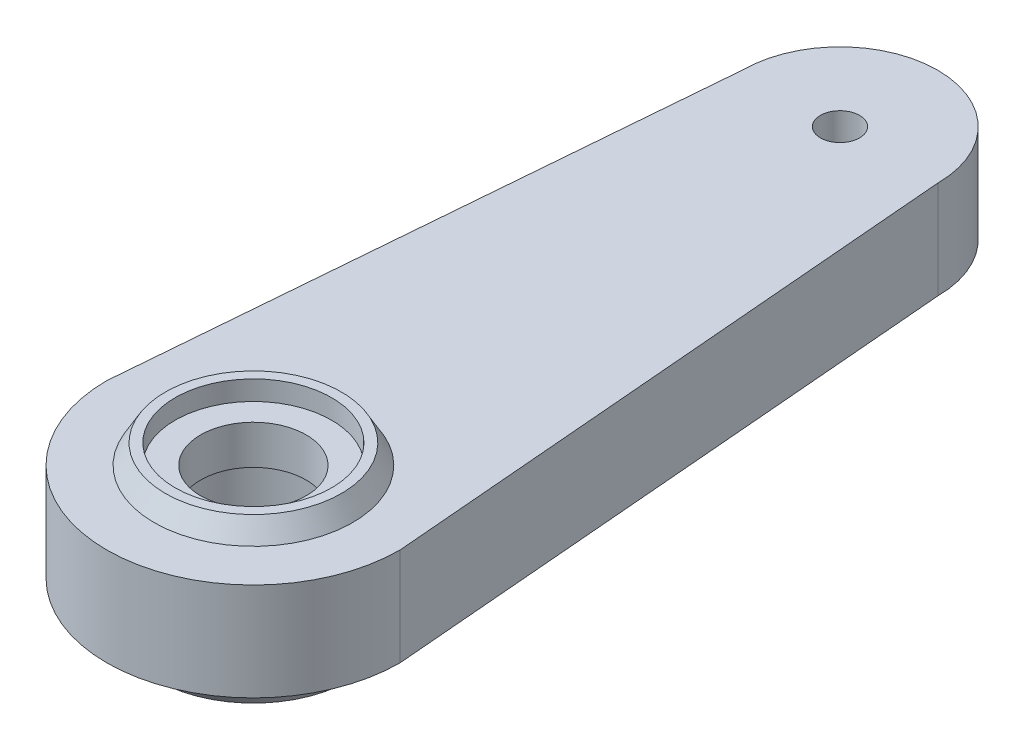
ISO-10303-21;
HEADER;
FILE_DESCRIPTION(('STEP AP214'),'2;1');
FILE_NAME('part.step','',(''),(''),'','','');
FILE_SCHEMA(('AUTOMOTIVE_DESIGN { 1 0 10303 214 1 1 1 1 }'));
ENDSEC;
DATA;
#1=APPLICATION_CONTEXT('core data for automotive mechanical design processes');
#2=APPLICATION_PROTOCOL_DEFINITION('international standard','automotive_design',2000,#1);
#3=PRODUCT_CONTEXT('',#1,'mechanical');
#4=PRODUCT('Part','Part','',(#3));
#5=PRODUCT_RELATED_PRODUCT_CATEGORY('part','',(#4));
#6=PRODUCT_DEFINITION_FORMATION('','',#4);
#7=PRODUCT_DEFINITION_CONTEXT('part definition',#1,'design');
#8=PRODUCT_DEFINITION('design','',#6,#7);
#9=PRODUCT_DEFINITION_SHAPE('','',#8);
#10=(LENGTH_UNIT() NAMED_UNIT(*) SI_UNIT(.MILLI.,.METRE.));
#11=(NAMED_UNIT(*) PLANE_ANGLE_UNIT() SI_UNIT($,.RADIAN.));
#12=(NAMED_UNIT(*) SI_UNIT($,.STERADIAN.) SOLID_ANGLE_UNIT());
#13=UNCERTAINTY_MEASURE_WITH_UNIT(LENGTH_MEASURE(1.E-05),#10,'distance_accuracy_value','');
#14=(GEOMETRIC_REPRESENTATION_CONTEXT(3) GLOBAL_UNCERTAINTY_ASSIGNED_CONTEXT((#13)) GLOBAL_UNIT_ASSIGNED_CONTEXT((#10,
#11,#12)) REPRESENTATION_CONTEXT('',''));
#15=CARTESIAN_POINT('',(0.,0.,0.));
#16=DIRECTION('',(0.,0.,1.));
#17=DIRECTION('',(1.,0.,0.));
#18=AXIS2_PLACEMENT_3D('',#15,#16,#17);
#19=CARTESIAN_POINT('',(0.,5.,0.));
#20=DIRECTION('',(0.,1.,0.));
#21=DIRECTION('',(0.,0.,1.));
#22=AXIS2_PLACEMENT_3D('',#19,#20,#21);
#23=PLANE('',#22);
#24=CARTESIAN_POINT('',(0.,5.,0.));
#25=DIRECTION('',(0.,1.,0.));
#26=DIRECTION('',(0.,0.,1.));
#27=AXIS2_PLACEMENT_3D('',#24,#25,#26);
#28=CIRCLE('',#27,2.7009170163784);
#29=CARTESIAN_POINT('',(0.,5.,2.7009170163784));
#30=VERTEX_POINT('',#29);
#31=EDGE_CURVE('E184',#30,#30,#28,.T.);
#32=ORIENTED_EDGE('',*,*,#31,.F.);
#33=EDGE_LOOP('',(#32));
#34=FACE_BOUND('',#33,.T.);
#35=CARTESIAN_POINT('',(0.,5.,0.));
#36=DIRECTION('',(0.,1.,0.));
#37=DIRECTION('',(0.,0.,1.));
#38=AXIS2_PLACEMENT_3D('',#35,#36,#37);
#39=CIRCLE('',#38,4.);
#40=CARTESIAN_POINT('',(0.,5.,4.));
#41=VERTEX_POINT('',#40);
#42=EDGE_CURVE('E11',#41,#41,#39,.F.);
#43=ORIENTED_EDGE('',*,*,#42,.F.);
#44=EDGE_LOOP('',(#43));
#45=FACE_BOUND('',#44,.T.);
#46=ADVANCED_FACE('F36',(#34,#45),#23,.T.);
#47=CARTESIAN_POINT('',(0.,0.,0.));
#48=DIRECTION('',(0.,1.,0.));
#49=DIRECTION('',(0.,0.,1.));
#50=AXIS2_PLACEMENT_3D('',#47,#48,#49);
#51=CYLINDRICAL_SURFACE('',#50,4.);
#52=CARTESIAN_POINT('',(0.,-2.,0.));
#53=DIRECTION('',(0.,1.,0.));
#54=DIRECTION('',(0.,0.,1.));
#55=AXIS2_PLACEMENT_3D('',#52,#53,#54);
#56=CIRCLE('',#55,4.);
#57=CARTESIAN_POINT('',(0.,-2.,4.));
#58=VERTEX_POINT('',#57);
#59=EDGE_CURVE('E180',#58,#58,#56,.T.);
#60=ORIENTED_EDGE('',*,*,#59,.F.);
#61=EDGE_LOOP('',(#60));
#62=FACE_BOUND('',#61,.T.);
#63=CARTESIAN_POINT('',(0.,3.,0.));
#64=DIRECTION('',(0.,1.,0.));
#65=DIRECTION('',(0.,0.,1.));
#66=AXIS2_PLACEMENT_3D('',#63,#64,#65);
#67=CIRCLE('',#66,4.);
#68=CARTESIAN_POINT('',(0.,3.,4.));
#69=VERTEX_POINT('',#68);
#70=EDGE_CURVE('E46',#69,#69,#67,.F.);
#71=ORIENTED_EDGE('',*,*,#70,.F.);
#72=EDGE_LOOP('',(#71));
#73=FACE_BOUND('',#72,.T.);
#74=ADVANCED_FACE('F123',(#62,#73),#51,.F.);
#75=CARTESIAN_POINT('',(0.,5.,0.));
#76=DIRECTION('',(0.,-1.,0.));
#77=DIRECTION('',(0.,0.,-1.));
#78=AXIS2_PLACEMENT_3D('',#75,#76,#77);
#79=CYLINDRICAL_SURFACE('',#78,7.5);
#80=CARTESIAN_POINT('',(0.,0.,0.));
#81=DIRECTION('',(0.,1.,0.));
#82=DIRECTION('',(0.,0.,1.));
#83=AXIS2_PLACEMENT_3D('',#80,#81,#82);
#84=CIRCLE('',#83,7.5);
#85=CARTESIAN_POINT('',(-7.5,0.,0.));
#86=VERTEX_POINT('',#85);
#87=CARTESIAN_POINT('',(7.5,0.,0.));
#88=VERTEX_POINT('',#87);
#89=EDGE_CURVE('E105',#86,#88,#84,.T.);
#90=ORIENTED_EDGE('',*,*,#89,.T.);
#91=DIRECTION('',(0.,-1.,0.));
#92=VECTOR('',#91,1.);
#93=CARTESIAN_POINT('',(7.5,5.,0.));
#94=LINE('',#93,#92);
#95=CARTESIAN_POINT('',(7.5,5.,0.));
#96=VERTEX_POINT('',#95);
#97=EDGE_CURVE('E96',#96,#88,#94,.T.);
#98=ORIENTED_EDGE('',*,*,#97,.F.);
#99=CARTESIAN_POINT('',(0.,5.,0.));
#100=DIRECTION('',(0.,1.,0.));
#101=DIRECTION('',(0.,0.,1.));
#102=AXIS2_PLACEMENT_3D('',#99,#100,#101);
#103=CIRCLE('',#102,7.5);
#104=CARTESIAN_POINT('',(-7.5,5.,0.));
#105=VERTEX_POINT('',#104);
#106=EDGE_CURVE('E90',#105,#96,#103,.T.);
#107=ORIENTED_EDGE('',*,*,#106,.F.);
#108=DIRECTION('',(0.,-1.,0.));
#109=VECTOR('',#108,1.);
#110=CARTESIAN_POINT('',(-7.5,5.,0.));
#111=LINE('',#110,#109);
#112=EDGE_CURVE('E101',#105,#86,#111,.T.);
#113=ORIENTED_EDGE('',*,*,#112,.T.);
#114=EDGE_LOOP('',(#90,#98,#107,#113));
#115=FACE_BOUND('',#114,.T.);
#116=ADVANCED_FACE('F125',(#115),#79,.T.);
#117=CARTESIAN_POINT('',(5.,5.,-30.));
#118=DIRECTION('',(-0.99654575824488,0.,0.08304547985374));
#119=DIRECTION('',(0.08304547985374,0.,0.99654575824488));
#120=AXIS2_PLACEMENT_3D('',#117,#118,#119);
#121=PLANE('',#120);
#122=DIRECTION('',(-0.08304547985374,0.,-0.99654575824488));
#123=VECTOR('',#122,1.);
#124=CARTESIAN_POINT('',(5.,0.,-30.));
#125=LINE('',#124,#123);
#126=CARTESIAN_POINT('',(5.,0.,-30.));
#127=VERTEX_POINT('',#126);
#128=EDGE_CURVE('E95',#88,#127,#125,.T.);
#129=ORIENTED_EDGE('',*,*,#128,.T.);
#130=DIRECTION('',(0.,-1.,0.));
#131=VECTOR('',#130,1.);
#132=CARTESIAN_POINT('',(5.,5.,-30.));
#133=LINE('',#132,#131);
#134=CARTESIAN_POINT('',(5.,5.,-30.));
#135=VERTEX_POINT('',#134);
#136=EDGE_CURVE('E93',#135,#127,#133,.T.);
#137=ORIENTED_EDGE('',*,*,#136,.F.);
#138=DIRECTION('',(-0.08304547985374,0.,-0.99654575824488));
#139=VECTOR('',#138,1.);
#140=CARTESIAN_POINT('',(5.,5.,-30.));
#141=LINE('',#140,#139);
#142=EDGE_CURVE('E85',#96,#135,#141,.T.);
#143=ORIENTED_EDGE('',*,*,#142,.F.);
#144=ORIENTED_EDGE('',*,*,#97,.T.);
#145=EDGE_LOOP('',(#129,#137,#143,#144));
#146=FACE_BOUND('',#145,.T.);
#147=ADVANCED_FACE('F94',(#146),#121,.F.);
#148=CARTESIAN_POINT('',(0.,5.,-30.));
#149=DIRECTION('',(0.,-1.,0.));
#150=DIRECTION('',(0.,0.,-1.));
#151=AXIS2_PLACEMENT_3D('',#148,#149,#150);
#152=CYLINDRICAL_SURFACE('',#151,5.);
#153=CARTESIAN_POINT('',(0.,0.,-30.));
#154=DIRECTION('',(0.,1.,0.));
#155=DIRECTION('',(0.,0.,1.));
#156=AXIS2_PLACEMENT_3D('',#153,#154,#155);
#157=CIRCLE('',#156,5.);
#158=CARTESIAN_POINT('',(-5.,0.,-30.));
#159=VERTEX_POINT('',#158);
#160=EDGE_CURVE('E71',#127,#159,#157,.T.);
#161=ORIENTED_EDGE('',*,*,#160,.T.);
#162=DIRECTION('',(0.,-1.,0.));
#163=VECTOR('',#162,1.);
#164=CARTESIAN_POINT('',(-5.,5.,-30.));
#165=LINE('',#164,#163);
#166=CARTESIAN_POINT('',(-5.,5.,-30.));
#167=VERTEX_POINT('',#166);
#168=EDGE_CURVE('E97',#167,#159,#165,.T.);
#169=ORIENTED_EDGE('',*,*,#168,.F.);
#170=CARTESIAN_POINT('',(0.,5.,-30.));
#171=DIRECTION('',(0.,1.,0.));
#172=DIRECTION('',(0.,0.,1.));
#173=AXIS2_PLACEMENT_3D('',#170,#171,#172);
#174=CIRCLE('',#173,5.);
#175=EDGE_CURVE('E88',#135,#167,#174,.T.);
#176=ORIENTED_EDGE('',*,*,#175,.F.);
#177=ORIENTED_EDGE('',*,*,#136,.T.);
#178=EDGE_LOOP('',(#161,#169,#176,#177));
#179=FACE_BOUND('',#178,.T.);
#180=ADVANCED_FACE('F99',(#179),#152,.T.);
#181=CARTESIAN_POINT('',(-7.5,5.,0.));
#182=DIRECTION('',(0.99654575824488,0.,0.08304547985374));
#183=DIRECTION('',(0.08304547985374,0.,-0.99654575824488));
#184=AXIS2_PLACEMENT_3D('',#181,#182,#183);
#185=PLANE('',#184);
#186=DIRECTION('',(-0.08304547985374,0.,0.99654575824488));
#187=VECTOR('',#186,1.);
#188=CARTESIAN_POINT('',(-7.5,0.,0.));
#189=LINE('',#188,#187);
#190=EDGE_CURVE('E77',#159,#86,#189,.T.);
#191=ORIENTED_EDGE('',*,*,#190,.T.);
#192=ORIENTED_EDGE('',*,*,#112,.F.);
#193=DIRECTION('',(-0.08304547985374,0.,0.99654575824488));
#194=VECTOR('',#193,1.);
#195=CARTESIAN_POINT('',(-7.5,5.,0.));
#196=LINE('',#195,#194);
#197=EDGE_CURVE('E54',#167,#105,#196,.T.);
#198=ORIENTED_EDGE('',*,*,#197,.F.);
#199=ORIENTED_EDGE('',*,*,#168,.T.);
#200=EDGE_LOOP('',(#191,#192,#198,#199));
#201=FACE_BOUND('',#200,.T.);
#202=ADVANCED_FACE('F148',(#201),#185,.F.);
#203=CARTESIAN_POINT('',(0.,5.,0.));
#204=DIRECTION('',(0.,1.,0.));
#205=DIRECTION('',(0.,0.,1.));
#206=AXIS2_PLACEMENT_3D('',#203,#204,#205);
#207=CIRCLE('',#206,5.07735026918963);
#208=CARTESIAN_POINT('',(0.,5.,5.07735026918963));
#209=VERTEX_POINT('',#208);
#210=EDGE_CURVE('E40',#209,#209,#207,.T.);
#211=ORIENTED_EDGE('',*,*,#210,.F.);
#212=EDGE_LOOP('',(#211));
#213=FACE_BOUND('',#212,.T.);
#214=CARTESIAN_POINT('',(0.,5.,-30.));
#215=DIRECTION('',(0.,1.,0.));
#216=DIRECTION('',(0.,0.,1.));
#217=AXIS2_PLACEMENT_3D('',#214,#215,#216);
#218=CIRCLE('',#217,1.);
#219=CARTESIAN_POINT('',(0.,5.,-29.));
#220=VERTEX_POINT('',#219);
#221=EDGE_CURVE('E175',#220,#220,#218,.T.);
#222=ORIENTED_EDGE('',*,*,#221,.F.);
#223=EDGE_LOOP('',(#222));
#224=FACE_BOUND('',#223,.T.);
#225=ORIENTED_EDGE('',*,*,#106,.T.);
#226=ORIENTED_EDGE('',*,*,#142,.T.);
#227=ORIENTED_EDGE('',*,*,#175,.T.);
#228=ORIENTED_EDGE('',*,*,#197,.T.);
#229=EDGE_LOOP('',(#225,#226,#227,#228));
#230=FACE_BOUND('',#229,.T.);
#231=ADVANCED_FACE('F86',(#213,#224,#230),#23,.T.);
#232=CARTESIAN_POINT('',(0.,0.,0.));
#233=DIRECTION('',(0.,1.,0.));
#234=DIRECTION('',(0.,0.,1.));
#235=AXIS2_PLACEMENT_3D('',#232,#233,#234);
#236=PLANE('',#235);
#237=CARTESIAN_POINT('',(0.,0.,0.));
#238=DIRECTION('',(0.,1.,0.));
#239=DIRECTION('',(0.,0.,1.));
#240=AXIS2_PLACEMENT_3D('',#237,#238,#239);
#241=CIRCLE('',#240,6.15470053837925);
#242=CARTESIAN_POINT('',(0.,0.,6.15470053837925));
#243=VERTEX_POINT('',#242);
#244=EDGE_CURVE('E115',#243,#243,#241,.F.);
#245=ORIENTED_EDGE('',*,*,#244,.F.);
#246=EDGE_LOOP('',(#245));
#247=FACE_BOUND('',#246,.T.);
#248=CARTESIAN_POINT('',(0.,0.,-30.));
#249=DIRECTION('',(0.,1.,0.));
#250=DIRECTION('',(0.,0.,1.));
#251=AXIS2_PLACEMENT_3D('',#248,#249,#250);
#252=CIRCLE('',#251,1.);
#253=CARTESIAN_POINT('',(0.,0.,-29.));
#254=VERTEX_POINT('',#253);
#255=EDGE_CURVE('E108',#254,#254,#252,.T.);
#256=ORIENTED_EDGE('',*,*,#255,.T.);
#257=EDGE_LOOP('',(#256));
#258=FACE_BOUND('',#257,.T.);
#259=ORIENTED_EDGE('',*,*,#89,.F.);
#260=ORIENTED_EDGE('',*,*,#190,.F.);
#261=ORIENTED_EDGE('',*,*,#160,.F.);
#262=ORIENTED_EDGE('',*,*,#128,.F.);
#263=EDGE_LOOP('',(#259,#260,#261,#262));
#264=FACE_BOUND('',#263,.T.);
#265=ADVANCED_FACE('F144',(#247,#258,#264),#236,.F.);
#266=CARTESIAN_POINT('',(0.,0.,-30.));
#267=DIRECTION('',(0.,1.,0.));
#268=DIRECTION('',(0.,0.,1.));
#269=AXIS2_PLACEMENT_3D('',#266,#267,#268);
#270=CYLINDRICAL_SURFACE('',#269,1.);
#271=ORIENTED_EDGE('',*,*,#255,.F.);
#272=EDGE_LOOP('',(#271));
#273=FACE_BOUND('',#272,.T.);
#274=ORIENTED_EDGE('',*,*,#221,.T.);
#275=EDGE_LOOP('',(#274));
#276=FACE_BOUND('',#275,.T.);
#277=ADVANCED_FACE('F141',(#273,#276),#270,.F.);
#278=CARTESIAN_POINT('',(0.,-2.,0.));
#279=DIRECTION('',(0.,1.,0.));
#280=DIRECTION('',(0.,0.,-1.));
#281=AXIS2_PLACEMENT_3D('',#278,#279,#280);
#282=CONICAL_SURFACE('',#281,5.,0.5235987755983);
#283=CARTESIAN_POINT('',(0.,-2.,0.));
#284=DIRECTION('',(0.,-1.,0.));
#285=DIRECTION('',(0.,0.,-1.));
#286=AXIS2_PLACEMENT_3D('',#283,#284,#285);
#287=CIRCLE('',#286,5.);
#288=CARTESIAN_POINT('',(0.,-2.,-5.));
#289=VERTEX_POINT('',#288);
#290=EDGE_CURVE('E167',#289,#289,#287,.T.);
#291=ORIENTED_EDGE('',*,*,#290,.F.);
#292=EDGE_LOOP('',(#291));
#293=FACE_BOUND('',#292,.T.);
#294=ORIENTED_EDGE('',*,*,#244,.T.);
#295=EDGE_LOOP('',(#294));
#296=FACE_BOUND('',#295,.T.);
#297=ADVANCED_FACE('F143',(#293,#296),#282,.T.);
#298=CARTESIAN_POINT('',(0.,-2.,0.));
#299=DIRECTION('',(0.,-1.,0.));
#300=DIRECTION('',(0.,0.,-1.));
#301=AXIS2_PLACEMENT_3D('',#298,#299,#300);
#302=PLANE('',#301);
#303=ORIENTED_EDGE('',*,*,#59,.T.);
#304=EDGE_LOOP('',(#303));
#305=FACE_BOUND('',#304,.T.);
#306=ORIENTED_EDGE('',*,*,#290,.T.);
#307=EDGE_LOOP('',(#306));
#308=FACE_BOUND('',#307,.T.);
#309=ADVANCED_FACE('F139',(#305,#308),#302,.T.);
#310=CARTESIAN_POINT('',(0.,3.,0.));
#311=DIRECTION('',(0.,1.,0.));
#312=DIRECTION('',(0.,0.,1.));
#313=AXIS2_PLACEMENT_3D('',#310,#311,#312);
#314=PLANE('',#313);
#315=CARTESIAN_POINT('',(0.,3.,0.));
#316=DIRECTION('',(0.,1.,0.));
#317=DIRECTION('',(0.,0.,1.));
#318=AXIS2_PLACEMENT_3D('',#315,#316,#317);
#319=CIRCLE('',#318,2.7009170163784);
#320=CARTESIAN_POINT('',(0.,3.,2.7009170163784));
#321=VERTEX_POINT('',#320);
#322=EDGE_CURVE('E183',#321,#321,#319,.T.);
#323=ORIENTED_EDGE('',*,*,#322,.T.);
#324=EDGE_LOOP('',(#323));
#325=FACE_BOUND('',#324,.T.);
#326=ORIENTED_EDGE('',*,*,#70,.T.);
#327=EDGE_LOOP('',(#326));
#328=FACE_BOUND('',#327,.T.);
#329=ADVANCED_FACE('F121',(#325,#328),#314,.F.);
#330=CARTESIAN_POINT('',(0.,3.,0.));
#331=DIRECTION('',(0.,1.,0.));
#332=DIRECTION('',(0.,0.,1.));
#333=AXIS2_PLACEMENT_3D('',#330,#331,#332);
#334=CYLINDRICAL_SURFACE('',#333,2.7009170163784);
#335=ORIENTED_EDGE('',*,*,#322,.F.);
#336=EDGE_LOOP('',(#335));
#337=FACE_BOUND('',#336,.T.);
#338=ORIENTED_EDGE('',*,*,#31,.T.);
#339=EDGE_LOOP('',(#338));
#340=FACE_BOUND('',#339,.T.);
#341=ADVANCED_FACE('F211',(#337,#340),#334,.F.);
#342=CARTESIAN_POINT('',(0.,6.,0.));
#343=DIRECTION('',(0.,1.,0.));
#344=DIRECTION('',(0.,0.,1.));
#345=AXIS2_PLACEMENT_3D('',#342,#343,#344);
#346=PLANE('',#345);
#347=CARTESIAN_POINT('',(0.,6.,0.));
#348=DIRECTION('',(0.,1.,0.));
#349=DIRECTION('',(0.,0.,1.));
#350=AXIS2_PLACEMENT_3D('',#347,#348,#349);
#351=CIRCLE('',#350,4.5);
#352=CARTESIAN_POINT('',(0.,6.,4.5));
#353=VERTEX_POINT('',#352);
#354=EDGE_CURVE('E187',#353,#353,#351,.T.);
#355=ORIENTED_EDGE('',*,*,#354,.T.);
#356=EDGE_LOOP('',(#355));
#357=FACE_BOUND('',#356,.T.);
#358=CARTESIAN_POINT('',(0.,6.,0.));
#359=DIRECTION('',(0.,1.,0.));
#360=DIRECTION('',(0.,0.,1.));
#361=AXIS2_PLACEMENT_3D('',#358,#359,#360);
#362=CIRCLE('',#361,4.);
#363=CARTESIAN_POINT('',(0.,6.,4.));
#364=VERTEX_POINT('',#363);
#365=EDGE_CURVE('E192',#364,#364,#362,.T.);
#366=ORIENTED_EDGE('',*,*,#365,.F.);
#367=EDGE_LOOP('',(#366));
#368=FACE_BOUND('',#367,.T.);
#369=ADVANCED_FACE('F204',(#357,#368),#346,.T.);
#370=CARTESIAN_POINT('',(0.,6.,0.));
#371=DIRECTION('',(0.,-1.,0.));
#372=DIRECTION('',(0.,0.,1.));
#373=AXIS2_PLACEMENT_3D('',#370,#371,#372);
#374=CONICAL_SURFACE('',#373,4.5,0.5235987755983);
#375=ORIENTED_EDGE('',*,*,#354,.F.);
#376=EDGE_LOOP('',(#375));
#377=FACE_BOUND('',#376,.T.);
#378=ORIENTED_EDGE('',*,*,#210,.T.);
#379=EDGE_LOOP('',(#378));
#380=FACE_BOUND('',#379,.T.);
#381=ADVANCED_FACE('F38',(#377,#380),#374,.T.);
#382=CARTESIAN_POINT('',(0.,6.,0.));
#383=DIRECTION('',(0.,-1.,0.));
#384=DIRECTION('',(0.,0.,-1.));
#385=AXIS2_PLACEMENT_3D('',#382,#383,#384);
#386=CYLINDRICAL_SURFACE('',#385,4.);
#387=ORIENTED_EDGE('',*,*,#365,.T.);
#388=EDGE_LOOP('',(#387));
#389=FACE_BOUND('',#388,.T.);
#390=ORIENTED_EDGE('',*,*,#42,.T.);
#391=EDGE_LOOP('',(#390));
#392=FACE_BOUND('',#391,.T.);
#393=ADVANCED_FACE('F203',(#389,#392),#386,.F.);
#394=CLOSED_SHELL('',(#46,#74,#116,#147,#180,#202,#231,#265,#277,#297,#309,#329,#341,#369,#381,#393));
#395=MANIFOLD_SOLID_BREP('B2',#394);
#396=ADVANCED_BREP_SHAPE_REPRESENTATION('',(#18,#395),#14);
#397=SHAPE_DEFINITION_REPRESENTATION(#9,#396);
ENDSEC;
END-ISO-10303-21;
